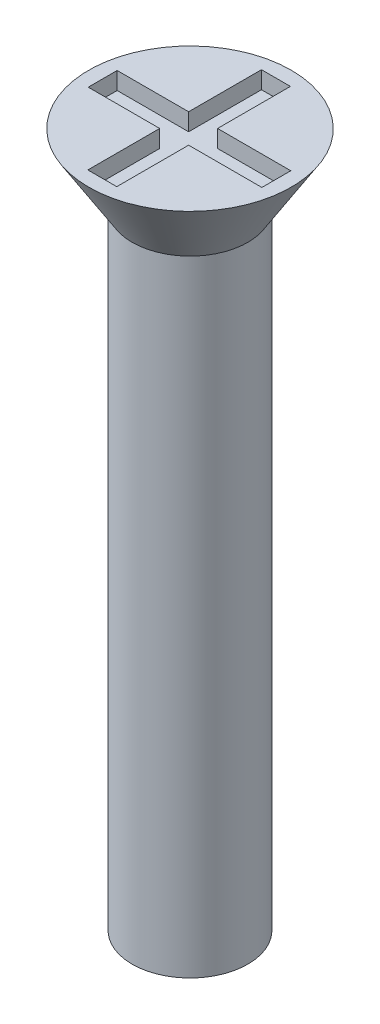
ISO-10303-21;
HEADER;
FILE_DESCRIPTION(('STEP AP214'),'2;1');
FILE_NAME('part.step','',(''),(''),'','','');
FILE_SCHEMA(('AUTOMOTIVE_DESIGN { 1 0 10303 214 1 1 1 1 }'));
ENDSEC;
DATA;
#1=APPLICATION_CONTEXT('core data for automotive mechanical design processes');
#2=APPLICATION_PROTOCOL_DEFINITION('international standard','automotive_design',2000,#1);
#3=PRODUCT_CONTEXT('',#1,'mechanical');
#4=PRODUCT('Part','Part','',(#3));
#5=PRODUCT_RELATED_PRODUCT_CATEGORY('part','',(#4));
#6=PRODUCT_DEFINITION_FORMATION('','',#4);
#7=PRODUCT_DEFINITION_CONTEXT('part definition',#1,'design');
#8=PRODUCT_DEFINITION('design','',#6,#7);
#9=PRODUCT_DEFINITION_SHAPE('','',#8);
#10=(LENGTH_UNIT() NAMED_UNIT(*) SI_UNIT(.MILLI.,.METRE.));
#11=(NAMED_UNIT(*) PLANE_ANGLE_UNIT() SI_UNIT($,.RADIAN.));
#12=(NAMED_UNIT(*) SI_UNIT($,.STERADIAN.) SOLID_ANGLE_UNIT());
#13=UNCERTAINTY_MEASURE_WITH_UNIT(LENGTH_MEASURE(1.E-05),#10,'distance_accuracy_value','');
#14=(GEOMETRIC_REPRESENTATION_CONTEXT(3) GLOBAL_UNCERTAINTY_ASSIGNED_CONTEXT((#13)) GLOBAL_UNIT_ASSIGNED_CONTEXT((#10,
#11,#12)) REPRESENTATION_CONTEXT('',''));
#15=CARTESIAN_POINT('',(0.,0.,0.));
#16=DIRECTION('',(0.,0.,1.));
#17=DIRECTION('',(1.,0.,0.));
#18=AXIS2_PLACEMENT_3D('',#15,#16,#17);
#19=CARTESIAN_POINT('',(0.,12.,0.));
#20=DIRECTION('',(0.,1.,0.));
#21=DIRECTION('',(0.,0.,1.));
#22=AXIS2_PLACEMENT_3D('',#19,#20,#21);
#23=PLANE('',#22);
#24=CARTESIAN_POINT('',(0.,12.,0.));
#25=DIRECTION('',(0.,1.,0.));
#26=DIRECTION('',(0.,0.,1.));
#27=AXIS2_PLACEMENT_3D('',#24,#25,#26);
#28=CIRCLE('',#27,1.75);
#29=CARTESIAN_POINT('',(0.,12.,1.75));
#30=VERTEX_POINT('',#29);
#31=EDGE_CURVE('E192',#30,#30,#28,.T.);
#32=ORIENTED_EDGE('',*,*,#31,.T.);
#33=EDGE_LOOP('',(#32));
#34=FACE_BOUND('',#33,.T.);
#35=DIRECTION('',(1.,0.,0.));
#36=VECTOR('',#35,1.);
#37=CARTESIAN_POINT('',(0.,12.,-1.5));
#38=LINE('',#37,#36);
#39=CARTESIAN_POINT('',(-0.265272843023468,12.,-1.5));
#40=VERTEX_POINT('',#39);
#41=CARTESIAN_POINT('',(0.234727156976532,12.,-1.5));
#42=VERTEX_POINT('',#41);
#43=EDGE_CURVE('E161',#40,#42,#38,.T.);
#44=ORIENTED_EDGE('',*,*,#43,.T.);
#45=DIRECTION('',(0.,0.,1.));
#46=VECTOR('',#45,1.);
#47=CARTESIAN_POINT('',(0.234727156976532,12.,0.));
#48=LINE('',#47,#46);
#49=CARTESIAN_POINT('',(0.234727156976532,12.,-0.241621514992573));
#50=VERTEX_POINT('',#49);
#51=EDGE_CURVE('E48',#42,#50,#48,.T.);
#52=ORIENTED_EDGE('',*,*,#51,.T.);
#53=DIRECTION('',(1.,0.,0.));
#54=VECTOR('',#53,1.);
#55=CARTESIAN_POINT('',(0.,12.,-0.241621514992573));
#56=LINE('',#55,#54);
#57=CARTESIAN_POINT('',(1.5,12.,-0.241621514992573));
#58=VERTEX_POINT('',#57);
#59=EDGE_CURVE('E98',#50,#58,#56,.T.);
#60=ORIENTED_EDGE('',*,*,#59,.T.);
#61=DIRECTION('',(0.,0.,1.));
#62=VECTOR('',#61,1.);
#63=CARTESIAN_POINT('',(1.5,12.,0.));
#64=LINE('',#63,#62);
#65=CARTESIAN_POINT('',(1.5,12.,0.258378485007427));
#66=VERTEX_POINT('',#65);
#67=EDGE_CURVE('E186',#58,#66,#64,.T.);
#68=ORIENTED_EDGE('',*,*,#67,.T.);
#69=DIRECTION('',(1.,0.,0.));
#70=VECTOR('',#69,1.);
#71=CARTESIAN_POINT('',(0.,12.,0.258378485007427));
#72=LINE('',#71,#70);
#73=CARTESIAN_POINT('',(0.234727156976532,12.,0.258378485007427));
#74=VERTEX_POINT('',#73);
#75=EDGE_CURVE('E145',#74,#66,#72,.T.);
#76=ORIENTED_EDGE('',*,*,#75,.F.);
#77=DIRECTION('',(0.,0.,1.));
#78=VECTOR('',#77,1.);
#79=CARTESIAN_POINT('',(0.234727156976532,12.,0.));
#80=LINE('',#79,#78);
#81=CARTESIAN_POINT('',(0.234727156976533,12.,1.5));
#82=VERTEX_POINT('',#81);
#83=EDGE_CURVE('E182',#74,#82,#80,.T.);
#84=ORIENTED_EDGE('',*,*,#83,.T.);
#85=DIRECTION('',(1.,0.,0.));
#86=VECTOR('',#85,1.);
#87=CARTESIAN_POINT('',(0.,12.,1.5));
#88=LINE('',#87,#86);
#89=CARTESIAN_POINT('',(-0.265272843023467,12.,1.5));
#90=VERTEX_POINT('',#89);
#91=EDGE_CURVE('E179',#90,#82,#88,.T.);
#92=ORIENTED_EDGE('',*,*,#91,.F.);
#93=DIRECTION('',(0.,0.,1.));
#94=VECTOR('',#93,1.);
#95=CARTESIAN_POINT('',(-0.265272843023468,12.,0.));
#96=LINE('',#95,#94);
#97=CARTESIAN_POINT('',(-0.265272843023468,12.,0.258378485007427));
#98=VERTEX_POINT('',#97);
#99=EDGE_CURVE('E176',#98,#90,#96,.T.);
#100=ORIENTED_EDGE('',*,*,#99,.F.);
#101=DIRECTION('',(1.,0.,0.));
#102=VECTOR('',#101,1.);
#103=CARTESIAN_POINT('',(0.,12.,0.258378485007427));
#104=LINE('',#103,#102);
#105=CARTESIAN_POINT('',(-1.5,12.,0.258378485007427));
#106=VERTEX_POINT('',#105);
#107=EDGE_CURVE('E173',#106,#98,#104,.T.);
#108=ORIENTED_EDGE('',*,*,#107,.F.);
#109=DIRECTION('',(0.,0.,1.));
#110=VECTOR('',#109,1.);
#111=CARTESIAN_POINT('',(-1.5,12.,0.));
#112=LINE('',#111,#110);
#113=CARTESIAN_POINT('',(-1.5,12.,-0.241621514992573));
#114=VERTEX_POINT('',#113);
#115=EDGE_CURVE('E170',#114,#106,#112,.T.);
#116=ORIENTED_EDGE('',*,*,#115,.F.);
#117=DIRECTION('',(1.,0.,0.));
#118=VECTOR('',#117,1.);
#119=CARTESIAN_POINT('',(0.,12.,-0.241621514992573));
#120=LINE('',#119,#118);
#121=CARTESIAN_POINT('',(-0.265272843023468,12.,-0.241621514992573));
#122=VERTEX_POINT('',#121);
#123=EDGE_CURVE('E167',#114,#122,#120,.T.);
#124=ORIENTED_EDGE('',*,*,#123,.T.);
#125=DIRECTION('',(0.,0.,1.));
#126=VECTOR('',#125,1.);
#127=CARTESIAN_POINT('',(-0.265272843023468,12.,0.));
#128=LINE('',#127,#126);
#129=EDGE_CURVE('E164',#40,#122,#128,.T.);
#130=ORIENTED_EDGE('',*,*,#129,.F.);
#131=EDGE_LOOP('',(#44,#52,#60,#68,#76,#84,#92,#100,#108,#116,#124,#130));
#132=FACE_BOUND('',#131,.T.);
#133=ADVANCED_FACE('F33',(#34,#132),#23,.T.);
#134=CARTESIAN_POINT('',(0.,12.,0.));
#135=DIRECTION('',(0.,-1.,0.));
#136=DIRECTION('',(0.,0.,-1.));
#137=AXIS2_PLACEMENT_3D('',#134,#135,#136);
#138=CYLINDRICAL_SURFACE('',#137,1.);
#139=CARTESIAN_POINT('',(0.,10.7997491032192,0.));
#140=DIRECTION('',(0.,1.,0.));
#141=DIRECTION('',(0.,0.,1.));
#142=AXIS2_PLACEMENT_3D('',#139,#140,#141);
#143=CIRCLE('',#142,1.);
#144=CARTESIAN_POINT('',(0.,10.7997491032192,1.));
#145=VERTEX_POINT('',#144);
#146=EDGE_CURVE('E37',#145,#145,#143,.F.);
#147=ORIENTED_EDGE('',*,*,#146,.T.);
#148=EDGE_LOOP('',(#147));
#149=FACE_BOUND('',#148,.T.);
#150=CARTESIAN_POINT('',(0.,0.,0.));
#151=DIRECTION('',(0.,1.,0.));
#152=DIRECTION('',(0.,0.,1.));
#153=AXIS2_PLACEMENT_3D('',#150,#151,#152);
#154=CIRCLE('',#153,1.);
#155=CARTESIAN_POINT('',(0.,0.,1.));
#156=VERTEX_POINT('',#155);
#157=EDGE_CURVE('E11',#156,#156,#154,.T.);
#158=ORIENTED_EDGE('',*,*,#157,.T.);
#159=EDGE_LOOP('',(#158));
#160=FACE_BOUND('',#159,.T.);
#161=ADVANCED_FACE('F35',(#149,#160),#138,.T.);
#162=CARTESIAN_POINT('',(0.,0.,0.));
#163=DIRECTION('',(0.,1.,0.));
#164=DIRECTION('',(0.,0.,1.));
#165=AXIS2_PLACEMENT_3D('',#162,#163,#164);
#166=PLANE('',#165);
#167=ORIENTED_EDGE('',*,*,#157,.F.);
#168=EDGE_LOOP('',(#167));
#169=FACE_BOUND('',#168,.T.);
#170=ADVANCED_FACE('F221',(#169),#166,.F.);
#171=CARTESIAN_POINT('',(0.,12.,0.));
#172=DIRECTION('',(0.,1.,0.));
#173=DIRECTION('',(0.,0.,1.));
#174=AXIS2_PLACEMENT_3D('',#171,#172,#173);
#175=CONICAL_SURFACE('',#174,1.75,0.558505360638187);
#176=ORIENTED_EDGE('',*,*,#31,.F.);
#177=EDGE_LOOP('',(#176));
#178=FACE_BOUND('',#177,.T.);
#179=ORIENTED_EDGE('',*,*,#146,.F.);
#180=EDGE_LOOP('',(#179));
#181=FACE_BOUND('',#180,.T.);
#182=ADVANCED_FACE('F218',(#178,#181),#175,.T.);
#183=CARTESIAN_POINT('',(0.234727156976532,11.7,0.));
#184=DIRECTION('',(-1.,0.,0.));
#185=DIRECTION('',(0.,0.,1.));
#186=AXIS2_PLACEMENT_3D('',#183,#184,#185);
#187=PLANE('',#186);
#188=ORIENTED_EDGE('',*,*,#51,.F.);
#189=DIRECTION('',(0.,1.,0.));
#190=VECTOR('',#189,1.);
#191=CARTESIAN_POINT('',(0.234727156976532,11.7,-1.5));
#192=LINE('',#191,#190);
#193=CARTESIAN_POINT('',(0.234727156976532,11.7,-1.5));
#194=VERTEX_POINT('',#193);
#195=EDGE_CURVE('E159',#194,#42,#192,.T.);
#196=ORIENTED_EDGE('',*,*,#195,.F.);
#197=DIRECTION('',(0.,0.,1.));
#198=VECTOR('',#197,1.);
#199=CARTESIAN_POINT('',(0.234727156976532,11.7,0.));
#200=LINE('',#199,#198);
#201=CARTESIAN_POINT('',(0.234727156976532,11.7,-0.241621514992573));
#202=VERTEX_POINT('',#201);
#203=EDGE_CURVE('E189',#194,#202,#200,.T.);
#204=ORIENTED_EDGE('',*,*,#203,.T.);
#205=DIRECTION('',(0.,1.,0.));
#206=VECTOR('',#205,1.);
#207=CARTESIAN_POINT('',(0.234727156976532,11.7,-0.241621514992573));
#208=LINE('',#207,#206);
#209=EDGE_CURVE('E190',#202,#50,#208,.T.);
#210=ORIENTED_EDGE('',*,*,#209,.T.);
#211=EDGE_LOOP('',(#188,#196,#204,#210));
#212=FACE_BOUND('',#211,.T.);
#213=ADVANCED_FACE('F220',(#212),#187,.T.);
#214=CARTESIAN_POINT('',(0.,11.7,-0.241621514992573));
#215=DIRECTION('',(0.,0.,1.));
#216=DIRECTION('',(1.,0.,0.));
#217=AXIS2_PLACEMENT_3D('',#214,#215,#216);
#218=PLANE('',#217);
#219=ORIENTED_EDGE('',*,*,#59,.F.);
#220=ORIENTED_EDGE('',*,*,#209,.F.);
#221=DIRECTION('',(1.,0.,0.));
#222=VECTOR('',#221,1.);
#223=CARTESIAN_POINT('',(0.,11.7,-0.241621514992573));
#224=LINE('',#223,#222);
#225=CARTESIAN_POINT('',(1.5,11.7,-0.241621514992573));
#226=VERTEX_POINT('',#225);
#227=EDGE_CURVE('E57',#202,#226,#224,.T.);
#228=ORIENTED_EDGE('',*,*,#227,.T.);
#229=DIRECTION('',(0.,1.,0.));
#230=VECTOR('',#229,1.);
#231=CARTESIAN_POINT('',(1.5,11.7,-0.241621514992573));
#232=LINE('',#231,#230);
#233=EDGE_CURVE('E137',#226,#58,#232,.T.);
#234=ORIENTED_EDGE('',*,*,#233,.T.);
#235=EDGE_LOOP('',(#219,#220,#228,#234));
#236=FACE_BOUND('',#235,.T.);
#237=ADVANCED_FACE('F228',(#236),#218,.T.);
#238=CARTESIAN_POINT('',(1.5,11.7,0.));
#239=DIRECTION('',(-1.,0.,0.));
#240=DIRECTION('',(0.,0.,1.));
#241=AXIS2_PLACEMENT_3D('',#238,#239,#240);
#242=PLANE('',#241);
#243=ORIENTED_EDGE('',*,*,#67,.F.);
#244=ORIENTED_EDGE('',*,*,#233,.F.);
#245=DIRECTION('',(0.,0.,1.));
#246=VECTOR('',#245,1.);
#247=CARTESIAN_POINT('',(1.5,11.7,0.));
#248=LINE('',#247,#246);
#249=CARTESIAN_POINT('',(1.5,11.7,0.258378485007427));
#250=VERTEX_POINT('',#249);
#251=EDGE_CURVE('E131',#226,#250,#248,.T.);
#252=ORIENTED_EDGE('',*,*,#251,.T.);
#253=DIRECTION('',(0.,1.,0.));
#254=VECTOR('',#253,1.);
#255=CARTESIAN_POINT('',(1.5,11.7,0.258378485007427));
#256=LINE('',#255,#254);
#257=EDGE_CURVE('E135',#250,#66,#256,.T.);
#258=ORIENTED_EDGE('',*,*,#257,.T.);
#259=EDGE_LOOP('',(#243,#244,#252,#258));
#260=FACE_BOUND('',#259,.T.);
#261=ADVANCED_FACE('F134',(#260),#242,.T.);
#262=CARTESIAN_POINT('',(0.,11.7,0.258378485007427));
#263=DIRECTION('',(0.,0.,1.));
#264=DIRECTION('',(1.,0.,0.));
#265=AXIS2_PLACEMENT_3D('',#262,#263,#264);
#266=PLANE('',#265);
#267=ORIENTED_EDGE('',*,*,#75,.T.);
#268=ORIENTED_EDGE('',*,*,#257,.F.);
#269=DIRECTION('',(1.,0.,0.));
#270=VECTOR('',#269,1.);
#271=CARTESIAN_POINT('',(0.,11.7,0.258378485007427));
#272=LINE('',#271,#270);
#273=CARTESIAN_POINT('',(0.234727156976532,11.7,0.258378485007427));
#274=VERTEX_POINT('',#273);
#275=EDGE_CURVE('E139',#274,#250,#272,.T.);
#276=ORIENTED_EDGE('',*,*,#275,.F.);
#277=DIRECTION('',(0.,1.,0.));
#278=VECTOR('',#277,1.);
#279=CARTESIAN_POINT('',(0.234727156976532,11.7,0.258378485007427));
#280=LINE('',#279,#278);
#281=EDGE_CURVE('E147',#274,#74,#280,.T.);
#282=ORIENTED_EDGE('',*,*,#281,.T.);
#283=EDGE_LOOP('',(#267,#268,#276,#282));
#284=FACE_BOUND('',#283,.T.);
#285=ADVANCED_FACE('F143',(#284),#266,.F.);
#286=CARTESIAN_POINT('',(0.234727156976532,11.7,0.));
#287=DIRECTION('',(-1.,0.,0.));
#288=DIRECTION('',(0.,0.,1.));
#289=AXIS2_PLACEMENT_3D('',#286,#287,#288);
#290=PLANE('',#289);
#291=ORIENTED_EDGE('',*,*,#83,.F.);
#292=ORIENTED_EDGE('',*,*,#281,.F.);
#293=DIRECTION('',(0.,0.,1.));
#294=VECTOR('',#293,1.);
#295=CARTESIAN_POINT('',(0.234727156976532,11.7,0.));
#296=LINE('',#295,#294);
#297=CARTESIAN_POINT('',(0.234727156976533,11.7,1.5));
#298=VERTEX_POINT('',#297);
#299=EDGE_CURVE('E152',#274,#298,#296,.T.);
#300=ORIENTED_EDGE('',*,*,#299,.T.);
#301=DIRECTION('',(0.,1.,0.));
#302=VECTOR('',#301,1.);
#303=CARTESIAN_POINT('',(0.234727156976533,11.7,1.5));
#304=LINE('',#303,#302);
#305=EDGE_CURVE('E195',#298,#82,#304,.T.);
#306=ORIENTED_EDGE('',*,*,#305,.T.);
#307=EDGE_LOOP('',(#291,#292,#300,#306));
#308=FACE_BOUND('',#307,.T.);
#309=ADVANCED_FACE('F265',(#308),#290,.T.);
#310=CARTESIAN_POINT('',(0.,11.7,1.5));
#311=DIRECTION('',(0.,0.,1.));
#312=DIRECTION('',(1.,0.,0.));
#313=AXIS2_PLACEMENT_3D('',#310,#311,#312);
#314=PLANE('',#313);
#315=ORIENTED_EDGE('',*,*,#91,.T.);
#316=ORIENTED_EDGE('',*,*,#305,.F.);
#317=DIRECTION('',(1.,0.,0.));
#318=VECTOR('',#317,1.);
#319=CARTESIAN_POINT('',(0.,11.7,1.5));
#320=LINE('',#319,#318);
#321=CARTESIAN_POINT('',(-0.265272843023467,11.7,1.5));
#322=VERTEX_POINT('',#321);
#323=EDGE_CURVE('E154',#322,#298,#320,.T.);
#324=ORIENTED_EDGE('',*,*,#323,.F.);
#325=DIRECTION('',(0.,1.,0.));
#326=VECTOR('',#325,1.);
#327=CARTESIAN_POINT('',(-0.265272843023467,11.7,1.5));
#328=LINE('',#327,#326);
#329=EDGE_CURVE('E197',#322,#90,#328,.T.);
#330=ORIENTED_EDGE('',*,*,#329,.T.);
#331=EDGE_LOOP('',(#315,#316,#324,#330));
#332=FACE_BOUND('',#331,.T.);
#333=ADVANCED_FACE('F261',(#332),#314,.F.);
#334=CARTESIAN_POINT('',(-0.265272843023468,11.7,0.));
#335=DIRECTION('',(-1.,0.,0.));
#336=DIRECTION('',(0.,0.,1.));
#337=AXIS2_PLACEMENT_3D('',#334,#335,#336);
#338=PLANE('',#337);
#339=ORIENTED_EDGE('',*,*,#99,.T.);
#340=ORIENTED_EDGE('',*,*,#329,.F.);
#341=DIRECTION('',(0.,0.,1.));
#342=VECTOR('',#341,1.);
#343=CARTESIAN_POINT('',(-0.265272843023468,11.7,0.));
#344=LINE('',#343,#342);
#345=CARTESIAN_POINT('',(-0.265272843023468,11.7,0.258378485007427));
#346=VERTEX_POINT('',#345);
#347=EDGE_CURVE('E255',#346,#322,#344,.T.);
#348=ORIENTED_EDGE('',*,*,#347,.F.);
#349=DIRECTION('',(0.,1.,0.));
#350=VECTOR('',#349,1.);
#351=CARTESIAN_POINT('',(-0.265272843023468,11.7,0.258378485007427));
#352=LINE('',#351,#350);
#353=EDGE_CURVE('E199',#346,#98,#352,.T.);
#354=ORIENTED_EDGE('',*,*,#353,.T.);
#355=EDGE_LOOP('',(#339,#340,#348,#354));
#356=FACE_BOUND('',#355,.T.);
#357=ADVANCED_FACE('F270',(#356),#338,.F.);
#358=CARTESIAN_POINT('',(0.,11.7,0.258378485007427));
#359=DIRECTION('',(0.,0.,1.));
#360=DIRECTION('',(1.,0.,0.));
#361=AXIS2_PLACEMENT_3D('',#358,#359,#360);
#362=PLANE('',#361);
#363=ORIENTED_EDGE('',*,*,#107,.T.);
#364=ORIENTED_EDGE('',*,*,#353,.F.);
#365=DIRECTION('',(1.,0.,0.));
#366=VECTOR('',#365,1.);
#367=CARTESIAN_POINT('',(0.,11.7,0.258378485007427));
#368=LINE('',#367,#366);
#369=CARTESIAN_POINT('',(-1.5,11.7,0.258378485007427));
#370=VERTEX_POINT('',#369);
#371=EDGE_CURVE('E252',#370,#346,#368,.T.);
#372=ORIENTED_EDGE('',*,*,#371,.F.);
#373=DIRECTION('',(0.,1.,0.));
#374=VECTOR('',#373,1.);
#375=CARTESIAN_POINT('',(-1.5,11.7,0.258378485007427));
#376=LINE('',#375,#374);
#377=EDGE_CURVE('E201',#370,#106,#376,.T.);
#378=ORIENTED_EDGE('',*,*,#377,.T.);
#379=EDGE_LOOP('',(#363,#364,#372,#378));
#380=FACE_BOUND('',#379,.T.);
#381=ADVANCED_FACE('F273',(#380),#362,.F.);
#382=CARTESIAN_POINT('',(-1.5,11.7,0.));
#383=DIRECTION('',(-1.,0.,0.));
#384=DIRECTION('',(0.,0.,1.));
#385=AXIS2_PLACEMENT_3D('',#382,#383,#384);
#386=PLANE('',#385);
#387=ORIENTED_EDGE('',*,*,#115,.T.);
#388=ORIENTED_EDGE('',*,*,#377,.F.);
#389=DIRECTION('',(0.,0.,1.));
#390=VECTOR('',#389,1.);
#391=CARTESIAN_POINT('',(-1.5,11.7,0.));
#392=LINE('',#391,#390);
#393=CARTESIAN_POINT('',(-1.5,11.7,-0.241621514992573));
#394=VERTEX_POINT('',#393);
#395=EDGE_CURVE('E249',#394,#370,#392,.T.);
#396=ORIENTED_EDGE('',*,*,#395,.F.);
#397=DIRECTION('',(0.,1.,0.));
#398=VECTOR('',#397,1.);
#399=CARTESIAN_POINT('',(-1.5,11.7,-0.241621514992573));
#400=LINE('',#399,#398);
#401=EDGE_CURVE('E203',#394,#114,#400,.T.);
#402=ORIENTED_EDGE('',*,*,#401,.T.);
#403=EDGE_LOOP('',(#387,#388,#396,#402));
#404=FACE_BOUND('',#403,.T.);
#405=ADVANCED_FACE('F276',(#404),#386,.F.);
#406=CARTESIAN_POINT('',(0.,11.7,-0.241621514992573));
#407=DIRECTION('',(0.,0.,1.));
#408=DIRECTION('',(1.,0.,0.));
#409=AXIS2_PLACEMENT_3D('',#406,#407,#408);
#410=PLANE('',#409);
#411=ORIENTED_EDGE('',*,*,#123,.F.);
#412=ORIENTED_EDGE('',*,*,#401,.F.);
#413=DIRECTION('',(1.,0.,0.));
#414=VECTOR('',#413,1.);
#415=CARTESIAN_POINT('',(0.,11.7,-0.241621514992573));
#416=LINE('',#415,#414);
#417=CARTESIAN_POINT('',(-0.265272843023468,11.7,-0.241621514992573));
#418=VERTEX_POINT('',#417);
#419=EDGE_CURVE('E247',#394,#418,#416,.T.);
#420=ORIENTED_EDGE('',*,*,#419,.T.);
#421=DIRECTION('',(0.,1.,0.));
#422=VECTOR('',#421,1.);
#423=CARTESIAN_POINT('',(-0.265272843023468,11.7,-0.241621514992573));
#424=LINE('',#423,#422);
#425=EDGE_CURVE('E205',#418,#122,#424,.T.);
#426=ORIENTED_EDGE('',*,*,#425,.T.);
#427=EDGE_LOOP('',(#411,#412,#420,#426));
#428=FACE_BOUND('',#427,.T.);
#429=ADVANCED_FACE('F279',(#428),#410,.T.);
#430=CARTESIAN_POINT('',(-0.265272843023468,11.7,0.));
#431=DIRECTION('',(-1.,0.,0.));
#432=DIRECTION('',(0.,0.,1.));
#433=AXIS2_PLACEMENT_3D('',#430,#431,#432);
#434=PLANE('',#433);
#435=ORIENTED_EDGE('',*,*,#129,.T.);
#436=ORIENTED_EDGE('',*,*,#425,.F.);
#437=DIRECTION('',(0.,0.,1.));
#438=VECTOR('',#437,1.);
#439=CARTESIAN_POINT('',(-0.265272843023468,11.7,0.));
#440=LINE('',#439,#438);
#441=CARTESIAN_POINT('',(-0.265272843023468,11.7,-1.5));
#442=VERTEX_POINT('',#441);
#443=EDGE_CURVE('E243',#442,#418,#440,.T.);
#444=ORIENTED_EDGE('',*,*,#443,.F.);
#445=DIRECTION('',(0.,1.,0.));
#446=VECTOR('',#445,1.);
#447=CARTESIAN_POINT('',(-0.265272843023468,11.7,-1.5));
#448=LINE('',#447,#446);
#449=EDGE_CURVE('E207',#442,#40,#448,.T.);
#450=ORIENTED_EDGE('',*,*,#449,.T.);
#451=EDGE_LOOP('',(#435,#436,#444,#450));
#452=FACE_BOUND('',#451,.T.);
#453=ADVANCED_FACE('F283',(#452),#434,.F.);
#454=CARTESIAN_POINT('',(0.,11.7,-1.5));
#455=DIRECTION('',(0.,0.,1.));
#456=DIRECTION('',(1.,0.,0.));
#457=AXIS2_PLACEMENT_3D('',#454,#455,#456);
#458=PLANE('',#457);
#459=ORIENTED_EDGE('',*,*,#43,.F.);
#460=ORIENTED_EDGE('',*,*,#449,.F.);
#461=DIRECTION('',(1.,0.,0.));
#462=VECTOR('',#461,1.);
#463=CARTESIAN_POINT('',(0.,11.7,-1.5));
#464=LINE('',#463,#462);
#465=EDGE_CURVE('E105',#442,#194,#464,.T.);
#466=ORIENTED_EDGE('',*,*,#465,.T.);
#467=ORIENTED_EDGE('',*,*,#195,.T.);
#468=EDGE_LOOP('',(#459,#460,#466,#467));
#469=FACE_BOUND('',#468,.T.);
#470=ADVANCED_FACE('F239',(#469),#458,.T.);
#471=CARTESIAN_POINT('',(0.,11.7,0.));
#472=DIRECTION('',(0.,1.,0.));
#473=DIRECTION('',(0.,0.,1.));
#474=AXIS2_PLACEMENT_3D('',#471,#472,#473);
#475=PLANE('',#474);
#476=ORIENTED_EDGE('',*,*,#203,.F.);
#477=ORIENTED_EDGE('',*,*,#465,.F.);
#478=ORIENTED_EDGE('',*,*,#443,.T.);
#479=ORIENTED_EDGE('',*,*,#419,.F.);
#480=ORIENTED_EDGE('',*,*,#395,.T.);
#481=ORIENTED_EDGE('',*,*,#371,.T.);
#482=ORIENTED_EDGE('',*,*,#347,.T.);
#483=ORIENTED_EDGE('',*,*,#323,.T.);
#484=ORIENTED_EDGE('',*,*,#299,.F.);
#485=ORIENTED_EDGE('',*,*,#275,.T.);
#486=ORIENTED_EDGE('',*,*,#251,.F.);
#487=ORIENTED_EDGE('',*,*,#227,.F.);
#488=EDGE_LOOP('',(#476,#477,#478,#479,#480,#481,#482,#483,#484,#485,#486,#487));
#489=FACE_BOUND('',#488,.T.);
#490=ADVANCED_FACE('F150',(#489),#475,.T.);
#491=CLOSED_SHELL('',(#133,#161,#170,#182,#213,#237,#261,#285,#309,#333,#357,#381,#405,#429,
#453,#470,#490));
#492=MANIFOLD_SOLID_BREP('B2',#491);
#493=ADVANCED_BREP_SHAPE_REPRESENTATION('',(#18,#492),#14);
#494=SHAPE_DEFINITION_REPRESENTATION(#9,#493);
ENDSEC;
END-ISO-10303-21;
